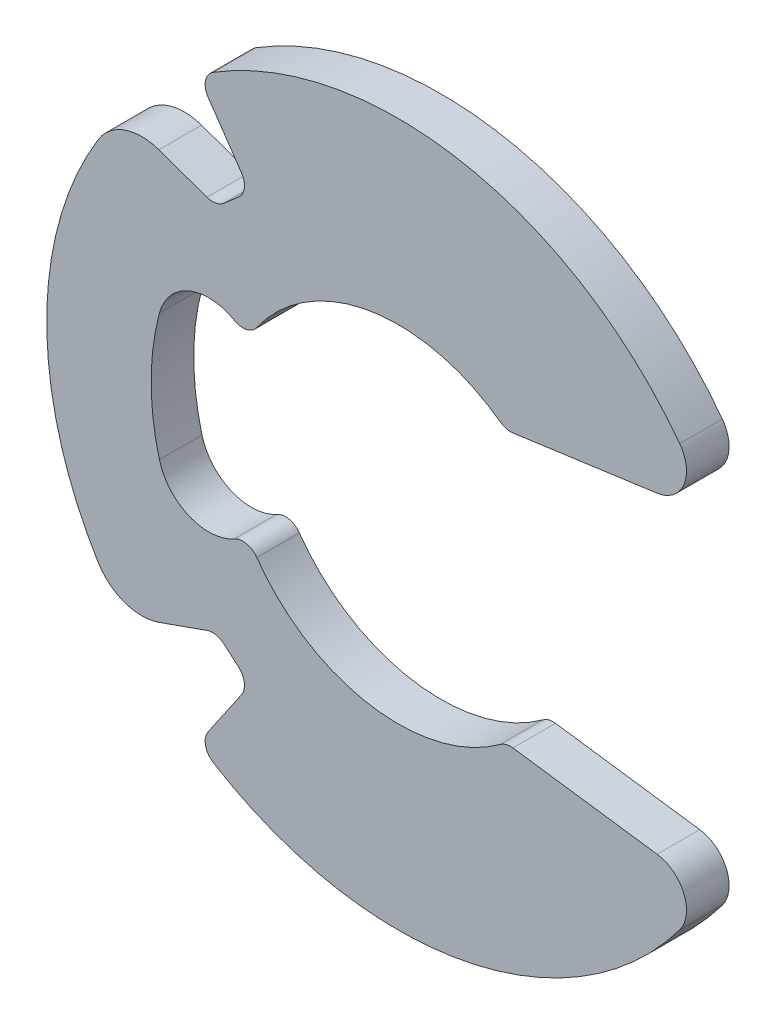
ISO-10303-21;
HEADER;
FILE_DESCRIPTION(('STEP AP214'),'2;1');
FILE_NAME('part.step','',(''),(''),'','','');
FILE_SCHEMA(('AUTOMOTIVE_DESIGN { 1 0 10303 214 1 1 1 1 }'));
ENDSEC;
DATA;
#1=APPLICATION_CONTEXT('core data for automotive mechanical design processes');
#2=APPLICATION_PROTOCOL_DEFINITION('international standard','automotive_design',2000,#1);
#3=PRODUCT_CONTEXT('',#1,'mechanical');
#4=PRODUCT('Part','Part','',(#3));
#5=PRODUCT_RELATED_PRODUCT_CATEGORY('part','',(#4));
#6=PRODUCT_DEFINITION_FORMATION('','',#4);
#7=PRODUCT_DEFINITION_CONTEXT('part definition',#1,'design');
#8=PRODUCT_DEFINITION('design','',#6,#7);
#9=PRODUCT_DEFINITION_SHAPE('','',#8);
#10=(LENGTH_UNIT() NAMED_UNIT(*) SI_UNIT(.MILLI.,.METRE.));
#11=(NAMED_UNIT(*) PLANE_ANGLE_UNIT() SI_UNIT($,.RADIAN.));
#12=(NAMED_UNIT(*) SI_UNIT($,.STERADIAN.) SOLID_ANGLE_UNIT());
#13=UNCERTAINTY_MEASURE_WITH_UNIT(LENGTH_MEASURE(1.E-05),#10,'distance_accuracy_value','');
#14=(GEOMETRIC_REPRESENTATION_CONTEXT(3) GLOBAL_UNCERTAINTY_ASSIGNED_CONTEXT((#13)) GLOBAL_UNIT_ASSIGNED_CONTEXT((#10,
#11,#12)) REPRESENTATION_CONTEXT('',''));
#15=CARTESIAN_POINT('',(0.,0.,0.));
#16=DIRECTION('',(0.,0.,1.));
#17=DIRECTION('',(1.,0.,0.));
#18=AXIS2_PLACEMENT_3D('',#15,#16,#17);
#19=CARTESIAN_POINT('',(0.,0.,1.27));
#20=DIRECTION('',(0.,0.,-1.));
#21=DIRECTION('',(-1.,0.,0.));
#22=AXIS2_PLACEMENT_3D('',#19,#20,#21);
#23=PLANE('',#22);
#24=CARTESIAN_POINT('',(7.57687706687955,-5.66664946537147,1.27));
#25=DIRECTION('',(0.,0.,-1.));
#26=DIRECTION('',(-1.,0.,0.));
#27=AXIS2_PLACEMENT_3D('',#24,#25,#26);
#28=CIRCLE('',#27,1.016);
#29=CARTESIAN_POINT('',(7.71621548730133,-4.66024954258016,1.27));
#30=VERTEX_POINT('',#29);
#31=CARTESIAN_POINT('',(8.39050144990017,-6.27514873682076,1.27));
#32=VERTEX_POINT('',#31);
#33=EDGE_CURVE('E376',#30,#32,#28,.T.);
#34=ORIENTED_EDGE('',*,*,#33,.F.);
#35=DIRECTION('',(0.990551105109562,-0.137144114588364,0.));
#36=VECTOR('',#35,1.);
#37=CARTESIAN_POINT('',(0.,-3.59192148204873,1.27));
#38=LINE('',#37,#36);
#39=CARTESIAN_POINT('',(3.41825205926127,-4.06518646523744,1.27));
#40=VERTEX_POINT('',#39);
#41=EDGE_CURVE('E377',#30,#40,#38,.F.);
#42=ORIENTED_EDGE('',*,*,#41,.T.);
#43=CARTESIAN_POINT('',(3.34858284905039,-4.5683864266331,1.27));
#44=DIRECTION('',(0.,0.,-1.));
#45=DIRECTION('',(-1.,0.,0.));
#46=AXIS2_PLACEMENT_3D('',#43,#44,#45);
#47=CIRCLE('',#46,0.508);
#48=CARTESIAN_POINT('',(3.04826151729699,-4.15866567088125,1.27));
#49=VERTEX_POINT('',#48);
#50=EDGE_CURVE('E20',#49,#40,#47,.T.);
#51=ORIENTED_EDGE('',*,*,#50,.F.);
#52=CARTESIAN_POINT('',(0.,0.,1.27));
#53=DIRECTION('',(0.,0.,-1.));
#54=DIRECTION('',(-1.,0.,0.));
#55=AXIS2_PLACEMENT_3D('',#52,#53,#54);
#56=CIRCLE('',#55,5.1562);
#57=CARTESIAN_POINT('',(-4.21618561440546,-2.96819428354689,1.27));
#58=VERTEX_POINT('',#57);
#59=EDGE_CURVE('E300',#49,#58,#56,.T.);
#60=ORIENTED_EDGE('',*,*,#59,.T.);
#61=CARTESIAN_POINT('',(-4.63157335966707,-3.26062721788648,1.27));
#62=DIRECTION('',(0.,0.,-1.));
#63=DIRECTION('',(-1.,0.,0.));
#64=AXIS2_PLACEMENT_3D('',#61,#62,#63);
#65=CIRCLE('',#64,0.508);
#66=CARTESIAN_POINT('',(-4.88521418696267,-2.82047913970278,1.27));
#67=VERTEX_POINT('',#66);
#68=EDGE_CURVE('E303',#67,#58,#65,.T.);
#69=ORIENTED_EDGE('',*,*,#68,.F.);
#70=CARTESIAN_POINT('',(-5.64613666884946,-1.50003490515168,1.27));
#71=DIRECTION('',(0.,0.,1.));
#72=DIRECTION('',(1.,0.,0.));
#73=AXIS2_PLACEMENT_3D('',#70,#71,#72);
#74=CIRCLE('',#73,1.524);
#75=CARTESIAN_POINT('',(-7.1190418868102,-1.89134835866951,1.27));
#76=VERTEX_POINT('',#75);
#77=EDGE_CURVE('E306',#67,#76,#74,.F.);
#78=ORIENTED_EDGE('',*,*,#77,.T.);
#79=CARTESIAN_POINT('',(0.,0.,1.27));
#80=DIRECTION('',(0.,0.,1.));
#81=DIRECTION('',(1.,0.,0.));
#82=AXIS2_PLACEMENT_3D('',#79,#80,#81);
#83=CIRCLE('',#82,7.366);
#84=CARTESIAN_POINT('',(-7.1190418868102,1.89134835866951,1.27));
#85=VERTEX_POINT('',#84);
#86=EDGE_CURVE('E310',#76,#85,#83,.F.);
#87=ORIENTED_EDGE('',*,*,#86,.T.);
#88=CARTESIAN_POINT('',(-5.64613666884946,1.50003490515168,1.27));
#89=DIRECTION('',(0.,0.,1.));
#90=DIRECTION('',(1.,0.,0.));
#91=AXIS2_PLACEMENT_3D('',#88,#89,#90);
#92=CIRCLE('',#91,1.524);
#93=CARTESIAN_POINT('',(-4.88521418696268,2.82047913970279,1.27));
#94=VERTEX_POINT('',#93);
#95=EDGE_CURVE('E314',#85,#94,#92,.F.);
#96=ORIENTED_EDGE('',*,*,#95,.T.);
#97=CARTESIAN_POINT('',(-4.63157335966708,3.26062721788649,1.27));
#98=DIRECTION('',(0.,0.,1.));
#99=DIRECTION('',(1.,0.,0.));
#100=AXIS2_PLACEMENT_3D('',#97,#98,#99);
#101=CIRCLE('',#100,0.508);
#102=CARTESIAN_POINT('',(-4.21618561440546,2.96819428354689,1.27));
#103=VERTEX_POINT('',#102);
#104=EDGE_CURVE('E316',#103,#94,#101,.F.);
#105=ORIENTED_EDGE('',*,*,#104,.F.);
#106=CARTESIAN_POINT('',(0.,0.,1.27));
#107=DIRECTION('',(0.,0.,-1.));
#108=DIRECTION('',(-1.,0.,0.));
#109=AXIS2_PLACEMENT_3D('',#106,#107,#108);
#110=CIRCLE('',#109,5.1562);
#111=CARTESIAN_POINT('',(3.048261517297,4.15866567088126,1.27));
#112=VERTEX_POINT('',#111);
#113=EDGE_CURVE('E320',#103,#112,#110,.T.);
#114=ORIENTED_EDGE('',*,*,#113,.T.);
#115=CARTESIAN_POINT('',(3.3485828490504,4.5683864266331,1.27));
#116=DIRECTION('',(0.,0.,-1.));
#117=DIRECTION('',(-1.,0.,0.));
#118=AXIS2_PLACEMENT_3D('',#115,#116,#117);
#119=CIRCLE('',#118,0.508);
#120=CARTESIAN_POINT('',(3.41825205926129,4.06518646523745,1.27));
#121=VERTEX_POINT('',#120);
#122=EDGE_CURVE('E324',#121,#112,#119,.T.);
#123=ORIENTED_EDGE('',*,*,#122,.F.);
#124=DIRECTION('',(-0.990551105109562,-0.137144114588364,0.));
#125=VECTOR('',#124,1.);
#126=CARTESIAN_POINT('',(11.2983179723503,5.15619999999999,1.27));
#127=LINE('',#126,#125);
#128=CARTESIAN_POINT('',(7.71621548730134,4.66024954258016,1.27));
#129=VERTEX_POINT('',#128);
#130=EDGE_CURVE('E330',#121,#129,#127,.F.);
#131=ORIENTED_EDGE('',*,*,#130,.T.);
#132=CARTESIAN_POINT('',(7.57687706687956,5.66664946537147,1.27));
#133=DIRECTION('',(0.,0.,-1.));
#134=DIRECTION('',(-1.,0.,0.));
#135=AXIS2_PLACEMENT_3D('',#132,#133,#134);
#136=CIRCLE('',#135,1.016);
#137=CARTESIAN_POINT('',(8.39050144990018,6.27514873682076,1.27));
#138=VERTEX_POINT('',#137);
#139=EDGE_CURVE('E327',#138,#129,#136,.T.);
#140=ORIENTED_EDGE('',*,*,#139,.F.);
#141=CARTESIAN_POINT('',(0.,0.,1.27));
#142=DIRECTION('',(0.,0.,-1.));
#143=DIRECTION('',(-1.,0.,0.));
#144=AXIS2_PLACEMENT_3D('',#141,#142,#143);
#145=CIRCLE('',#144,10.4775);
#146=CARTESIAN_POINT('',(-5.51465485817056,8.90879273780999,1.27));
#147=VERTEX_POINT('',#146);
#148=EDGE_CURVE('E332',#147,#138,#145,.T.);
#149=ORIENTED_EDGE('',*,*,#148,.F.);
#150=CARTESIAN_POINT('',(-5.24727765292592,8.47685127173435,1.27));
#151=DIRECTION('',(0.,0.,-1.));
#152=DIRECTION('',(-1.,0.,0.));
#153=AXIS2_PLACEMENT_3D('',#150,#151,#152);
#154=CIRCLE('',#153,0.508);
#155=CARTESIAN_POINT('',(-5.6664647231543,8.18989099547063,1.27));
#156=VERTEX_POINT('',#155);
#157=EDGE_CURVE('E335',#156,#147,#154,.T.);
#158=ORIENTED_EDGE('',*,*,#157,.F.);
#159=DIRECTION('',(0.564882433590001,-0.825171398087354,0.));
#160=VECTOR('',#159,1.);
#161=CARTESIAN_POINT('',(-7.96096866359448,11.541666359447,1.27));
#162=LINE('',#161,#160);
#163=CARTESIAN_POINT('',(-4.67174469224146,6.73681957776462,1.27));
#164=VERTEX_POINT('',#163);
#165=EDGE_CURVE('E386',#164,#156,#162,.F.);
#166=ORIENTED_EDGE('',*,*,#165,.F.);
#167=CARTESIAN_POINT('',(-5.09093176246983,6.4498593015009,1.27));
#168=DIRECTION('',(0.,0.,-1.));
#169=DIRECTION('',(-1.,0.,0.));
#170=AXIS2_PLACEMENT_3D('',#167,#168,#169);
#171=CIRCLE('',#170,0.508);
#172=CARTESIAN_POINT('',(-4.75923843445855,6.0650950410078,1.27000000000001));
#173=VERTEX_POINT('',#172);
#174=EDGE_CURVE('E339',#164,#173,#171,.T.);
#175=ORIENTED_EDGE('',*,*,#174,.T.);
#176=DIRECTION('',(-0.757409961600578,-0.652939622069462,0.));
#177=VECTOR('',#176,1.);
#178=CARTESIAN_POINT('',(-4.41503502304148,6.36182211981562,1.27000000000001));
#179=LINE('',#178,#177);
#180=CARTESIAN_POINT('',(-5.19974545035898,5.68534761350743,1.27000000000001));
#181=VERTEX_POINT('',#180);
#182=EDGE_CURVE('E390',#181,#173,#179,.F.);
#183=ORIENTED_EDGE('',*,*,#182,.F.);
#184=CARTESIAN_POINT('',(-5.53143877837027,6.07011187400052,1.27));
#185=DIRECTION('',(0.,0.,-1.));
#186=DIRECTION('',(-1.,0.,0.));
#187=AXIS2_PLACEMENT_3D('',#184,#185,#186);
#188=CIRCLE('',#187,0.508);
#189=CARTESIAN_POINT('',(-5.70123922502142,5.59133028672186,1.27));
#190=VERTEX_POINT('',#189);
#191=EDGE_CURVE('E343',#181,#190,#188,.T.);
#192=ORIENTED_EDGE('',*,*,#191,.T.);
#193=DIRECTION('',(-0.942483439524914,0.334252847738487,0.));
#194=VECTOR('',#193,1.);
#195=CARTESIAN_POINT('',(-5.42319262672811,5.49272073732714,1.27));
#196=LINE('',#195,#194);
#197=CARTESIAN_POINT('',(-7.13394241485243,6.09944013892937,1.27));
#198=VERTEX_POINT('',#197);
#199=EDGE_CURVE('E393',#198,#190,#196,.F.);
#200=ORIENTED_EDGE('',*,*,#199,.F.);
#201=CARTESIAN_POINT('',(-7.64334375480589,4.6630953770934,1.27));
#202=DIRECTION('',(0.,0.,-1.));
#203=DIRECTION('',(-1.,0.,0.));
#204=AXIS2_PLACEMENT_3D('',#201,#202,#203);
#205=CIRCLE('',#204,1.524);
#206=CARTESIAN_POINT('',(-8.94433843647498,5.45681373915185,1.27));
#207=VERTEX_POINT('',#206);
#208=EDGE_CURVE('E347',#207,#198,#205,.T.);
#209=ORIENTED_EDGE('',*,*,#208,.F.);
#210=CARTESIAN_POINT('',(0.,0.,1.27));
#211=DIRECTION('',(0.,0.,-1.));
#212=DIRECTION('',(-1.,0.,0.));
#213=AXIS2_PLACEMENT_3D('',#210,#211,#212);
#214=CIRCLE('',#213,10.4775);
#215=CARTESIAN_POINT('',(-8.94433843647497,-5.45681373915185,1.27));
#216=VERTEX_POINT('',#215);
#217=EDGE_CURVE('E351',#216,#207,#214,.T.);
#218=ORIENTED_EDGE('',*,*,#217,.F.);
#219=CARTESIAN_POINT('',(-7.64334375480588,-4.6630953770934,1.27));
#220=DIRECTION('',(0.,0.,-1.));
#221=DIRECTION('',(-1.,0.,0.));
#222=AXIS2_PLACEMENT_3D('',#219,#220,#221);
#223=CIRCLE('',#222,1.524);
#224=CARTESIAN_POINT('',(-7.13394241485243,-6.09944013892937,1.27));
#225=VERTEX_POINT('',#224);
#226=EDGE_CURVE('E355',#225,#216,#223,.T.);
#227=ORIENTED_EDGE('',*,*,#226,.F.);
#228=DIRECTION('',(-0.942483439524914,-0.334252847738487,0.));
#229=VECTOR('',#228,1.);
#230=CARTESIAN_POINT('',(-5.42319262672811,-5.49272073732714,1.27));
#231=LINE('',#230,#229);
#232=CARTESIAN_POINT('',(-5.70123922502142,-5.59133028672186,1.27));
#233=VERTEX_POINT('',#232);
#234=EDGE_CURVE('E396',#225,#233,#231,.F.);
#235=ORIENTED_EDGE('',*,*,#234,.T.);
#236=CARTESIAN_POINT('',(-5.53143877837027,-6.07011187400052,1.27));
#237=DIRECTION('',(0.,0.,-1.));
#238=DIRECTION('',(-1.,0.,0.));
#239=AXIS2_PLACEMENT_3D('',#236,#237,#238);
#240=CIRCLE('',#239,0.508);
#241=CARTESIAN_POINT('',(-5.19974545035898,-5.68534761350743,1.27000000000001));
#242=VERTEX_POINT('',#241);
#243=EDGE_CURVE('E360',#233,#242,#240,.T.);
#244=ORIENTED_EDGE('',*,*,#243,.T.);
#245=DIRECTION('',(-0.757409961600578,0.652939622069462,0.));
#246=VECTOR('',#245,1.);
#247=CARTESIAN_POINT('',(-4.41503502304148,-6.36182211981562,1.27000000000001));
#248=LINE('',#247,#246);
#249=CARTESIAN_POINT('',(-4.75923843445855,-6.0650950410078,1.27000000000001));
#250=VERTEX_POINT('',#249);
#251=EDGE_CURVE('E398',#242,#250,#248,.F.);
#252=ORIENTED_EDGE('',*,*,#251,.T.);
#253=CARTESIAN_POINT('',(-5.09093176246983,-6.4498593015009,1.27));
#254=DIRECTION('',(0.,0.,-1.));
#255=DIRECTION('',(-1.,0.,0.));
#256=AXIS2_PLACEMENT_3D('',#253,#254,#255);
#257=CIRCLE('',#256,0.508);
#258=CARTESIAN_POINT('',(-4.67174469224146,-6.73681957776462,1.27));
#259=VERTEX_POINT('',#258);
#260=EDGE_CURVE('E364',#250,#259,#257,.T.);
#261=ORIENTED_EDGE('',*,*,#260,.T.);
#262=DIRECTION('',(0.56488243359,0.825171398087354,0.));
#263=VECTOR('',#262,1.);
#264=CARTESIAN_POINT('',(-7.96096866359448,-11.541666359447,1.27));
#265=LINE('',#264,#263);
#266=CARTESIAN_POINT('',(-5.66646472315429,-8.18989099547062,1.27));
#267=VERTEX_POINT('',#266);
#268=EDGE_CURVE('E371',#259,#267,#265,.F.);
#269=ORIENTED_EDGE('',*,*,#268,.T.);
#270=CARTESIAN_POINT('',(-5.24727765292592,-8.47685127173434,1.27));
#271=DIRECTION('',(0.,0.,-1.));
#272=DIRECTION('',(-1.,0.,0.));
#273=AXIS2_PLACEMENT_3D('',#270,#271,#272);
#274=CIRCLE('',#273,0.508);
#275=CARTESIAN_POINT('',(-5.51465485817055,-8.90879273780997,1.27));
#276=VERTEX_POINT('',#275);
#277=EDGE_CURVE('E368',#276,#267,#274,.T.);
#278=ORIENTED_EDGE('',*,*,#277,.F.);
#279=CARTESIAN_POINT('',(0.,0.,1.27));
#280=DIRECTION('',(0.,0.,-1.));
#281=DIRECTION('',(-1.,0.,0.));
#282=AXIS2_PLACEMENT_3D('',#279,#280,#281);
#283=CIRCLE('',#282,10.4775);
#284=EDGE_CURVE('E373',#32,#276,#283,.T.);
#285=ORIENTED_EDGE('',*,*,#284,.F.);
#286=EDGE_LOOP('',(#34,#42,#51,#60,#69,#78,#87,#96,#105,#114,#123,#131,#140,#149,#158,#166,#175,
#183,#192,#200,#209,#218,#227,#235,#244,#252,#261,#269,#278,#285));
#287=FACE_BOUND('',#286,.T.);
#288=ADVANCED_FACE('F17',(#287),#23,.F.);
#289=CARTESIAN_POINT('',(0.,-3.59192148204873,-28.9774986298856));
#290=DIRECTION('',(-0.137144114588364,-0.990551105109562,0.));
#291=DIRECTION('',(0.990551105109562,-0.137144114588364,0.));
#292=AXIS2_PLACEMENT_3D('',#289,#290,#291);
#293=PLANE('',#292);
#294=DIRECTION('',(0.,0.,-1.));
#295=VECTOR('',#294,1.);
#296=CARTESIAN_POINT('',(7.71621548730133,-4.66024954258016,1.27));
#297=LINE('',#296,#295);
#298=CARTESIAN_POINT('',(7.71621548730133,-4.66024954258016,0.));
#299=VERTEX_POINT('',#298);
#300=EDGE_CURVE('E222',#299,#30,#297,.F.);
#301=ORIENTED_EDGE('',*,*,#300,.F.);
#302=DIRECTION('',(0.990551105109562,-0.137144114588363,0.));
#303=VECTOR('',#302,1.);
#304=CARTESIAN_POINT('',(3.41825205926127,-4.06518646523744,0.));
#305=LINE('',#304,#303);
#306=CARTESIAN_POINT('',(3.41825205926127,-4.06518646523744,0.));
#307=VERTEX_POINT('',#306);
#308=EDGE_CURVE('E217',#307,#299,#305,.T.);
#309=ORIENTED_EDGE('',*,*,#308,.F.);
#310=DIRECTION('',(0.,0.,-1.));
#311=VECTOR('',#310,1.);
#312=CARTESIAN_POINT('',(3.41825205926127,-4.06518646523744,1.27));
#313=LINE('',#312,#311);
#314=EDGE_CURVE('E220',#40,#307,#313,.T.);
#315=ORIENTED_EDGE('',*,*,#314,.F.);
#316=ORIENTED_EDGE('',*,*,#41,.F.);
#317=EDGE_LOOP('',(#301,#309,#315,#316));
#318=FACE_BOUND('',#317,.T.);
#319=ADVANCED_FACE('F218',(#318),#293,.F.);
#320=CARTESIAN_POINT('',(7.57687706687955,-5.66664946537147,1.27));
#321=DIRECTION('',(0.,0.,-1.));
#322=DIRECTION('',(-1.,0.,0.));
#323=AXIS2_PLACEMENT_3D('',#320,#321,#322);
#324=CYLINDRICAL_SURFACE('',#323,1.016);
#325=CARTESIAN_POINT('',(7.57687706687955,-5.66664946537147,0.));
#326=DIRECTION('',(0.,0.,-1.));
#327=DIRECTION('',(-1.,0.,0.));
#328=AXIS2_PLACEMENT_3D('',#325,#326,#327);
#329=CIRCLE('',#328,1.016);
#330=CARTESIAN_POINT('',(8.39050144990017,-6.27514873682076,0.));
#331=VERTEX_POINT('',#330);
#332=EDGE_CURVE('E226',#299,#331,#329,.T.);
#333=ORIENTED_EDGE('',*,*,#332,.F.);
#334=ORIENTED_EDGE('',*,*,#300,.T.);
#335=ORIENTED_EDGE('',*,*,#33,.T.);
#336=DIRECTION('',(0.,0.,-1.));
#337=VECTOR('',#336,1.);
#338=CARTESIAN_POINT('',(8.39050144990017,-6.27514873682076,1.27));
#339=LINE('',#338,#337);
#340=EDGE_CURVE('E375',#331,#32,#339,.F.);
#341=ORIENTED_EDGE('',*,*,#340,.F.);
#342=EDGE_LOOP('',(#333,#334,#335,#341));
#343=FACE_BOUND('',#342,.T.);
#344=ADVANCED_FACE('F414',(#343),#324,.T.);
#345=CARTESIAN_POINT('',(0.,0.,1.27));
#346=DIRECTION('',(0.,0.,-1.));
#347=DIRECTION('',(-1.,0.,0.));
#348=AXIS2_PLACEMENT_3D('',#345,#346,#347);
#349=CYLINDRICAL_SURFACE('',#348,10.4775);
#350=ORIENTED_EDGE('',*,*,#284,.T.);
#351=DIRECTION('',(0.,0.,-1.));
#352=VECTOR('',#351,1.);
#353=CARTESIAN_POINT('',(-5.51465485817055,-8.90879273780998,1.27));
#354=LINE('',#353,#352);
#355=CARTESIAN_POINT('',(-5.51465485817055,-8.90879273780997,0.));
#356=VERTEX_POINT('',#355);
#357=EDGE_CURVE('E372',#356,#276,#354,.F.);
#358=ORIENTED_EDGE('',*,*,#357,.F.);
#359=CARTESIAN_POINT('',(0.,0.,0.));
#360=DIRECTION('',(0.,0.,-1.));
#361=DIRECTION('',(-1.,0.,0.));
#362=AXIS2_PLACEMENT_3D('',#359,#360,#361);
#363=CIRCLE('',#362,10.4775);
#364=EDGE_CURVE('E296',#331,#356,#363,.T.);
#365=ORIENTED_EDGE('',*,*,#364,.F.);
#366=ORIENTED_EDGE('',*,*,#340,.T.);
#367=EDGE_LOOP('',(#350,#358,#365,#366));
#368=FACE_BOUND('',#367,.T.);
#369=ADVANCED_FACE('F413',(#368),#349,.T.);
#370=CARTESIAN_POINT('',(-5.24727765292592,-8.47685127173434,1.27));
#371=DIRECTION('',(0.,0.,-1.));
#372=DIRECTION('',(-1.,0.,0.));
#373=AXIS2_PLACEMENT_3D('',#370,#371,#372);
#374=CYLINDRICAL_SURFACE('',#373,0.508);
#375=DIRECTION('',(0.,0.,1.));
#376=VECTOR('',#375,1.);
#377=CARTESIAN_POINT('',(-5.66646472315429,-8.18989099547062,-28.9619533727259));
#378=LINE('',#377,#376);
#379=CARTESIAN_POINT('',(-5.6664647231543,-8.18989099547062,0.));
#380=VERTEX_POINT('',#379);
#381=EDGE_CURVE('E367',#267,#380,#378,.F.);
#382=ORIENTED_EDGE('',*,*,#381,.T.);
#383=CARTESIAN_POINT('',(-5.24727765292592,-8.47685127173434,0.));
#384=DIRECTION('',(0.,0.,-1.));
#385=DIRECTION('',(-1.,0.,0.));
#386=AXIS2_PLACEMENT_3D('',#383,#384,#385);
#387=CIRCLE('',#386,0.508);
#388=EDGE_CURVE('E294',#356,#380,#387,.T.);
#389=ORIENTED_EDGE('',*,*,#388,.F.);
#390=ORIENTED_EDGE('',*,*,#357,.T.);
#391=ORIENTED_EDGE('',*,*,#277,.T.);
#392=EDGE_LOOP('',(#382,#389,#390,#391));
#393=FACE_BOUND('',#392,.T.);
#394=ADVANCED_FACE('F416',(#393),#374,.T.);
#395=CARTESIAN_POINT('',(-7.96096866359448,-11.541666359447,-28.9619533727259));
#396=DIRECTION('',(0.825171398087354,-0.56488243359,0.));
#397=DIRECTION('',(0.56488243359,0.825171398087354,0.));
#398=AXIS2_PLACEMENT_3D('',#395,#396,#397);
#399=PLANE('',#398);
#400=ORIENTED_EDGE('',*,*,#381,.F.);
#401=ORIENTED_EDGE('',*,*,#268,.F.);
#402=DIRECTION('',(0.,0.,-1.));
#403=VECTOR('',#402,1.);
#404=CARTESIAN_POINT('',(-4.67174469224146,-6.73681957776462,-28.9619533727259));
#405=LINE('',#404,#403);
#406=CARTESIAN_POINT('',(-4.67174469224146,-6.73681957776462,0.));
#407=VERTEX_POINT('',#406);
#408=EDGE_CURVE('E366',#259,#407,#405,.T.);
#409=ORIENTED_EDGE('',*,*,#408,.T.);
#410=DIRECTION('',(0.564882433590003,0.825171398087353,0.));
#411=VECTOR('',#410,1.);
#412=CARTESIAN_POINT('',(-5.6664647231543,-8.18989099547062,0.));
#413=LINE('',#412,#411);
#414=EDGE_CURVE('E293',#380,#407,#413,.T.);
#415=ORIENTED_EDGE('',*,*,#414,.F.);
#416=EDGE_LOOP('',(#400,#401,#409,#415));
#417=FACE_BOUND('',#416,.T.);
#418=ADVANCED_FACE('F418',(#417),#399,.F.);
#419=CARTESIAN_POINT('',(-5.09093176246983,-6.4498593015009,-28.9619533727259));
#420=DIRECTION('',(0.,0.,-1.));
#421=DIRECTION('',(-1.,0.,0.));
#422=AXIS2_PLACEMENT_3D('',#419,#420,#421);
#423=CYLINDRICAL_SURFACE('',#422,0.508);
#424=ORIENTED_EDGE('',*,*,#408,.F.);
#425=ORIENTED_EDGE('',*,*,#260,.F.);
#426=DIRECTION('',(0.,0.,1.));
#427=VECTOR('',#426,1.);
#428=CARTESIAN_POINT('',(-4.75923843445855,-6.0650950410078,-28.9619533727259));
#429=LINE('',#428,#427);
#430=CARTESIAN_POINT('',(-4.75923843445855,-6.0650950410078,0.));
#431=VERTEX_POINT('',#430);
#432=EDGE_CURVE('E363',#250,#431,#429,.F.);
#433=ORIENTED_EDGE('',*,*,#432,.T.);
#434=CARTESIAN_POINT('',(-5.09093176246983,-6.4498593015009,0.));
#435=DIRECTION('',(0.,0.,-1.));
#436=DIRECTION('',(-1.,0.,0.));
#437=AXIS2_PLACEMENT_3D('',#434,#435,#436);
#438=CIRCLE('',#437,0.508);
#439=EDGE_CURVE('E290',#407,#431,#438,.F.);
#440=ORIENTED_EDGE('',*,*,#439,.F.);
#441=EDGE_LOOP('',(#424,#425,#433,#440));
#442=FACE_BOUND('',#441,.T.);
#443=ADVANCED_FACE('F463',(#442),#423,.F.);
#444=CARTESIAN_POINT('',(-4.41503502304148,-6.36182211981562,-28.9619533727259));
#445=DIRECTION('',(0.652939622069462,0.757409961600578,0.));
#446=DIRECTION('',(-0.757409961600578,0.652939622069462,0.));
#447=AXIS2_PLACEMENT_3D('',#444,#445,#446);
#448=PLANE('',#447);
#449=ORIENTED_EDGE('',*,*,#432,.F.);
#450=ORIENTED_EDGE('',*,*,#251,.F.);
#451=DIRECTION('',(0.,0.,-1.));
#452=VECTOR('',#451,1.);
#453=CARTESIAN_POINT('',(-5.19974545035899,-5.68534761350743,-28.9619533727259));
#454=LINE('',#453,#452);
#455=CARTESIAN_POINT('',(-5.19974545035898,-5.68534761350743,0.));
#456=VERTEX_POINT('',#455);
#457=EDGE_CURVE('E362',#242,#456,#454,.T.);
#458=ORIENTED_EDGE('',*,*,#457,.T.);
#459=DIRECTION('',(-0.757409961600581,0.652939622069458,0.));
#460=VECTOR('',#459,1.);
#461=CARTESIAN_POINT('',(-4.75923843445854,-6.0650950410078,0.));
#462=LINE('',#461,#460);
#463=EDGE_CURVE('E289',#431,#456,#462,.T.);
#464=ORIENTED_EDGE('',*,*,#463,.F.);
#465=EDGE_LOOP('',(#449,#450,#458,#464));
#466=FACE_BOUND('',#465,.T.);
#467=ADVANCED_FACE('F467',(#466),#448,.F.);
#468=CARTESIAN_POINT('',(-5.53143877837027,-6.07011187400052,-28.9619533727259));
#469=DIRECTION('',(0.,0.,-1.));
#470=DIRECTION('',(-1.,0.,0.));
#471=AXIS2_PLACEMENT_3D('',#468,#469,#470);
#472=CYLINDRICAL_SURFACE('',#471,0.508);
#473=ORIENTED_EDGE('',*,*,#457,.F.);
#474=ORIENTED_EDGE('',*,*,#243,.F.);
#475=DIRECTION('',(0.,0.,1.));
#476=VECTOR('',#475,1.);
#477=CARTESIAN_POINT('',(-5.70123922502142,-5.59133028672186,-28.9619533727259));
#478=LINE('',#477,#476);
#479=CARTESIAN_POINT('',(-5.70123922502142,-5.59133028672186,0.));
#480=VERTEX_POINT('',#479);
#481=EDGE_CURVE('E359',#233,#480,#478,.F.);
#482=ORIENTED_EDGE('',*,*,#481,.T.);
#483=CARTESIAN_POINT('',(-5.53143877837027,-6.07011187400052,0.));
#484=DIRECTION('',(0.,0.,-1.));
#485=DIRECTION('',(-1.,0.,0.));
#486=AXIS2_PLACEMENT_3D('',#483,#484,#485);
#487=CIRCLE('',#486,0.508);
#488=EDGE_CURVE('E286',#456,#480,#487,.F.);
#489=ORIENTED_EDGE('',*,*,#488,.F.);
#490=EDGE_LOOP('',(#473,#474,#482,#489));
#491=FACE_BOUND('',#490,.T.);
#492=ADVANCED_FACE('F473',(#491),#472,.F.);
#493=CARTESIAN_POINT('',(-5.42319262672811,-5.49272073732714,-28.9619533727259));
#494=DIRECTION('',(-0.334252847738487,0.942483439524914,0.));
#495=DIRECTION('',(-0.942483439524914,-0.334252847738487,0.));
#496=AXIS2_PLACEMENT_3D('',#493,#494,#495);
#497=PLANE('',#496);
#498=ORIENTED_EDGE('',*,*,#481,.F.);
#499=ORIENTED_EDGE('',*,*,#234,.F.);
#500=DIRECTION('',(0.,0.,-1.));
#501=VECTOR('',#500,1.);
#502=CARTESIAN_POINT('',(-7.13394241485243,-6.09944013892937,1.27));
#503=LINE('',#502,#501);
#504=CARTESIAN_POINT('',(-7.13394241485243,-6.09944013892937,0.));
#505=VERTEX_POINT('',#504);
#506=EDGE_CURVE('E358',#505,#225,#503,.F.);
#507=ORIENTED_EDGE('',*,*,#506,.F.);
#508=DIRECTION('',(-0.942483439524914,-0.334252847738488,0.));
#509=VECTOR('',#508,1.);
#510=CARTESIAN_POINT('',(-5.70123922502142,-5.59133028672186,0.));
#511=LINE('',#510,#509);
#512=EDGE_CURVE('E285',#480,#505,#511,.T.);
#513=ORIENTED_EDGE('',*,*,#512,.F.);
#514=EDGE_LOOP('',(#498,#499,#507,#513));
#515=FACE_BOUND('',#514,.T.);
#516=ADVANCED_FACE('F478',(#515),#497,.F.);
#517=CARTESIAN_POINT('',(-7.64334375480588,-4.6630953770934,1.27));
#518=DIRECTION('',(0.,0.,-1.));
#519=DIRECTION('',(-1.,0.,0.));
#520=AXIS2_PLACEMENT_3D('',#517,#518,#519);
#521=CYLINDRICAL_SURFACE('',#520,1.524);
#522=CARTESIAN_POINT('',(-7.64334375480588,-4.6630953770934,0.));
#523=DIRECTION('',(0.,0.,-1.));
#524=DIRECTION('',(-1.,0.,0.));
#525=AXIS2_PLACEMENT_3D('',#522,#523,#524);
#526=CIRCLE('',#525,1.524);
#527=CARTESIAN_POINT('',(-8.94433843647497,-5.45681373915185,0.));
#528=VERTEX_POINT('',#527);
#529=EDGE_CURVE('E282',#505,#528,#526,.T.);
#530=ORIENTED_EDGE('',*,*,#529,.F.);
#531=ORIENTED_EDGE('',*,*,#506,.T.);
#532=ORIENTED_EDGE('',*,*,#226,.T.);
#533=DIRECTION('',(0.,0.,-1.));
#534=VECTOR('',#533,1.);
#535=CARTESIAN_POINT('',(-8.94433843647497,-5.45681373915185,1.27));
#536=LINE('',#535,#534);
#537=EDGE_CURVE('E354',#528,#216,#536,.F.);
#538=ORIENTED_EDGE('',*,*,#537,.F.);
#539=EDGE_LOOP('',(#530,#531,#532,#538));
#540=FACE_BOUND('',#539,.T.);
#541=ADVANCED_FACE('F559',(#540),#521,.T.);
#542=CARTESIAN_POINT('',(0.,0.,1.27));
#543=DIRECTION('',(0.,0.,-1.));
#544=DIRECTION('',(-1.,0.,0.));
#545=AXIS2_PLACEMENT_3D('',#542,#543,#544);
#546=CYLINDRICAL_SURFACE('',#545,10.4775);
#547=DIRECTION('',(0.,0.,-1.));
#548=VECTOR('',#547,1.);
#549=CARTESIAN_POINT('',(-8.94433843647498,5.45681373915185,1.27));
#550=LINE('',#549,#548);
#551=CARTESIAN_POINT('',(-8.94433843647498,5.45681373915185,0.));
#552=VERTEX_POINT('',#551);
#553=EDGE_CURVE('E350',#552,#207,#550,.F.);
#554=ORIENTED_EDGE('',*,*,#553,.F.);
#555=CARTESIAN_POINT('',(0.,0.,0.));
#556=DIRECTION('',(0.,0.,-1.));
#557=DIRECTION('',(-1.,0.,0.));
#558=AXIS2_PLACEMENT_3D('',#555,#556,#557);
#559=CIRCLE('',#558,10.4775);
#560=EDGE_CURVE('E280',#528,#552,#559,.T.);
#561=ORIENTED_EDGE('',*,*,#560,.F.);
#562=ORIENTED_EDGE('',*,*,#537,.T.);
#563=ORIENTED_EDGE('',*,*,#217,.T.);
#564=EDGE_LOOP('',(#554,#561,#562,#563));
#565=FACE_BOUND('',#564,.T.);
#566=ADVANCED_FACE('F557',(#565),#546,.T.);
#567=CARTESIAN_POINT('',(-7.64334375480589,4.6630953770934,1.27));
#568=DIRECTION('',(0.,0.,-1.));
#569=DIRECTION('',(-1.,0.,0.));
#570=AXIS2_PLACEMENT_3D('',#567,#568,#569);
#571=CYLINDRICAL_SURFACE('',#570,1.524);
#572=CARTESIAN_POINT('',(-7.64334375480589,4.6630953770934,0.));
#573=DIRECTION('',(0.,0.,-1.));
#574=DIRECTION('',(-1.,0.,0.));
#575=AXIS2_PLACEMENT_3D('',#572,#573,#574);
#576=CIRCLE('',#575,1.524);
#577=CARTESIAN_POINT('',(-7.13394241485243,6.09944013892937,0.));
#578=VERTEX_POINT('',#577);
#579=EDGE_CURVE('E277',#552,#578,#576,.T.);
#580=ORIENTED_EDGE('',*,*,#579,.F.);
#581=ORIENTED_EDGE('',*,*,#553,.T.);
#582=ORIENTED_EDGE('',*,*,#208,.T.);
#583=DIRECTION('',(0.,0.,1.));
#584=VECTOR('',#583,1.);
#585=CARTESIAN_POINT('',(-7.13394241485243,6.09944013892937,-28.9619533727259));
#586=LINE('',#585,#584);
#587=EDGE_CURVE('E346',#578,#198,#586,.T.);
#588=ORIENTED_EDGE('',*,*,#587,.F.);
#589=EDGE_LOOP('',(#580,#581,#582,#588));
#590=FACE_BOUND('',#589,.T.);
#591=ADVANCED_FACE('F553',(#590),#571,.T.);
#592=CARTESIAN_POINT('',(-5.42319262672811,5.49272073732714,-28.9619533727259));
#593=DIRECTION('',(0.334252847738487,0.942483439524914,0.));
#594=DIRECTION('',(-0.942483439524914,0.334252847738487,0.));
#595=AXIS2_PLACEMENT_3D('',#592,#593,#594);
#596=PLANE('',#595);
#597=DIRECTION('',(0.942483439524914,-0.334252847738487,0.));
#598=VECTOR('',#597,1.);
#599=CARTESIAN_POINT('',(-7.13394241485243,6.09944013892937,0.));
#600=LINE('',#599,#598);
#601=CARTESIAN_POINT('',(-5.70123922502142,5.59133028672186,0.));
#602=VERTEX_POINT('',#601);
#603=EDGE_CURVE('E276',#578,#602,#600,.T.);
#604=ORIENTED_EDGE('',*,*,#603,.F.);
#605=ORIENTED_EDGE('',*,*,#587,.T.);
#606=ORIENTED_EDGE('',*,*,#199,.T.);
#607=DIRECTION('',(0.,0.,-1.));
#608=VECTOR('',#607,1.);
#609=CARTESIAN_POINT('',(-5.70123922502142,5.59133028672186,-28.9619533727259));
#610=LINE('',#609,#608);
#611=EDGE_CURVE('E345',#190,#602,#610,.T.);
#612=ORIENTED_EDGE('',*,*,#611,.T.);
#613=EDGE_LOOP('',(#604,#605,#606,#612));
#614=FACE_BOUND('',#613,.T.);
#615=ADVANCED_FACE('F550',(#614),#596,.T.);
#616=CARTESIAN_POINT('',(-5.53143877837027,6.07011187400052,-28.9619533727259));
#617=DIRECTION('',(0.,0.,-1.));
#618=DIRECTION('',(-1.,0.,0.));
#619=AXIS2_PLACEMENT_3D('',#616,#617,#618);
#620=CYLINDRICAL_SURFACE('',#619,0.508);
#621=ORIENTED_EDGE('',*,*,#611,.F.);
#622=ORIENTED_EDGE('',*,*,#191,.F.);
#623=DIRECTION('',(0.,0.,1.));
#624=VECTOR('',#623,1.);
#625=CARTESIAN_POINT('',(-5.19974545035898,5.68534761350743,-28.9619533727259));
#626=LINE('',#625,#624);
#627=CARTESIAN_POINT('',(-5.19974545035898,5.68534761350743,0.));
#628=VERTEX_POINT('',#627);
#629=EDGE_CURVE('E342',#628,#181,#626,.T.);
#630=ORIENTED_EDGE('',*,*,#629,.F.);
#631=CARTESIAN_POINT('',(-5.53143877837027,6.07011187400052,0.));
#632=DIRECTION('',(0.,0.,-1.));
#633=DIRECTION('',(-1.,0.,0.));
#634=AXIS2_PLACEMENT_3D('',#631,#632,#633);
#635=CIRCLE('',#634,0.508);
#636=EDGE_CURVE('E273',#602,#628,#635,.F.);
#637=ORIENTED_EDGE('',*,*,#636,.F.);
#638=EDGE_LOOP('',(#621,#622,#630,#637));
#639=FACE_BOUND('',#638,.T.);
#640=ADVANCED_FACE('F546',(#639),#620,.F.);
#641=CARTESIAN_POINT('',(-4.41503502304148,6.36182211981562,-28.9619533727259));
#642=DIRECTION('',(-0.652939622069462,0.757409961600578,0.));
#643=DIRECTION('',(-0.757409961600578,-0.652939622069462,0.));
#644=AXIS2_PLACEMENT_3D('',#641,#642,#643);
#645=PLANE('',#644);
#646=DIRECTION('',(0.757409961600573,0.652939622069468,0.));
#647=VECTOR('',#646,1.);
#648=CARTESIAN_POINT('',(-5.19974545035898,5.68534761350743,0.));
#649=LINE('',#648,#647);
#650=CARTESIAN_POINT('',(-4.75923843445855,6.0650950410078,0.));
#651=VERTEX_POINT('',#650);
#652=EDGE_CURVE('E272',#628,#651,#649,.T.);
#653=ORIENTED_EDGE('',*,*,#652,.F.);
#654=ORIENTED_EDGE('',*,*,#629,.T.);
#655=ORIENTED_EDGE('',*,*,#182,.T.);
#656=DIRECTION('',(0.,0.,-1.));
#657=VECTOR('',#656,1.);
#658=CARTESIAN_POINT('',(-4.75923843445855,6.0650950410078,-28.9619533727259));
#659=LINE('',#658,#657);
#660=EDGE_CURVE('E341',#173,#651,#659,.T.);
#661=ORIENTED_EDGE('',*,*,#660,.T.);
#662=EDGE_LOOP('',(#653,#654,#655,#661));
#663=FACE_BOUND('',#662,.T.);
#664=ADVANCED_FACE('F542',(#663),#645,.T.);
#665=CARTESIAN_POINT('',(-5.09093176246983,6.4498593015009,-28.9619533727259));
#666=DIRECTION('',(0.,0.,-1.));
#667=DIRECTION('',(-1.,0.,0.));
#668=AXIS2_PLACEMENT_3D('',#665,#666,#667);
#669=CYLINDRICAL_SURFACE('',#668,0.508);
#670=ORIENTED_EDGE('',*,*,#660,.F.);
#671=ORIENTED_EDGE('',*,*,#174,.F.);
#672=DIRECTION('',(0.,0.,1.));
#673=VECTOR('',#672,1.);
#674=CARTESIAN_POINT('',(-4.67174469224146,6.73681957776462,-28.9619533727259));
#675=LINE('',#674,#673);
#676=CARTESIAN_POINT('',(-4.67174469224146,6.73681957776462,0.));
#677=VERTEX_POINT('',#676);
#678=EDGE_CURVE('E389',#677,#164,#675,.T.);
#679=ORIENTED_EDGE('',*,*,#678,.F.);
#680=CARTESIAN_POINT('',(-5.09093176246983,6.4498593015009,0.));
#681=DIRECTION('',(0.,0.,-1.));
#682=DIRECTION('',(-1.,0.,0.));
#683=AXIS2_PLACEMENT_3D('',#680,#681,#682);
#684=CIRCLE('',#683,0.508);
#685=EDGE_CURVE('E269',#651,#677,#684,.F.);
#686=ORIENTED_EDGE('',*,*,#685,.F.);
#687=EDGE_LOOP('',(#670,#671,#679,#686));
#688=FACE_BOUND('',#687,.T.);
#689=ADVANCED_FACE('F538',(#688),#669,.F.);
#690=CARTESIAN_POINT('',(-7.96096866359448,11.541666359447,-28.9619533727259));
#691=DIRECTION('',(-0.825171398087354,-0.564882433590001,0.));
#692=DIRECTION('',(0.564882433590001,-0.825171398087354,0.));
#693=AXIS2_PLACEMENT_3D('',#690,#691,#692);
#694=PLANE('',#693);
#695=DIRECTION('',(-0.56488243359,0.825171398087354,0.));
#696=VECTOR('',#695,1.);
#697=CARTESIAN_POINT('',(-4.67174469224146,6.73681957776462,0.));
#698=LINE('',#697,#696);
#699=CARTESIAN_POINT('',(-5.6664647231543,8.18989099547063,0.));
#700=VERTEX_POINT('',#699);
#701=EDGE_CURVE('E268',#677,#700,#698,.T.);
#702=ORIENTED_EDGE('',*,*,#701,.F.);
#703=ORIENTED_EDGE('',*,*,#678,.T.);
#704=ORIENTED_EDGE('',*,*,#165,.T.);
#705=DIRECTION('',(0.,0.,-1.));
#706=VECTOR('',#705,1.);
#707=CARTESIAN_POINT('',(-5.6664647231543,8.18989099547063,1.27));
#708=LINE('',#707,#706);
#709=EDGE_CURVE('E338',#700,#156,#708,.F.);
#710=ORIENTED_EDGE('',*,*,#709,.F.);
#711=EDGE_LOOP('',(#702,#703,#704,#710));
#712=FACE_BOUND('',#711,.T.);
#713=ADVANCED_FACE('F534',(#712),#694,.T.);
#714=CARTESIAN_POINT('',(-5.24727765292592,8.47685127173435,1.27));
#715=DIRECTION('',(0.,0.,-1.));
#716=DIRECTION('',(-1.,0.,0.));
#717=AXIS2_PLACEMENT_3D('',#714,#715,#716);
#718=CYLINDRICAL_SURFACE('',#717,0.508);
#719=DIRECTION('',(0.,0.,-1.));
#720=VECTOR('',#719,1.);
#721=CARTESIAN_POINT('',(-5.51465485817056,8.90879273780999,1.27));
#722=LINE('',#721,#720);
#723=CARTESIAN_POINT('',(-5.51465485817056,8.90879273780999,0.));
#724=VERTEX_POINT('',#723);
#725=EDGE_CURVE('E334',#724,#147,#722,.F.);
#726=ORIENTED_EDGE('',*,*,#725,.F.);
#727=CARTESIAN_POINT('',(-5.24727765292592,8.47685127173435,0.));
#728=DIRECTION('',(0.,0.,-1.));
#729=DIRECTION('',(-1.,0.,0.));
#730=AXIS2_PLACEMENT_3D('',#727,#728,#729);
#731=CIRCLE('',#730,0.508);
#732=EDGE_CURVE('E266',#700,#724,#731,.T.);
#733=ORIENTED_EDGE('',*,*,#732,.F.);
#734=ORIENTED_EDGE('',*,*,#709,.T.);
#735=ORIENTED_EDGE('',*,*,#157,.T.);
#736=EDGE_LOOP('',(#726,#733,#734,#735));
#737=FACE_BOUND('',#736,.T.);
#738=ADVANCED_FACE('F530',(#737),#718,.T.);
#739=CARTESIAN_POINT('',(0.,0.,1.27));
#740=DIRECTION('',(0.,0.,-1.));
#741=DIRECTION('',(-1.,0.,0.));
#742=AXIS2_PLACEMENT_3D('',#739,#740,#741);
#743=CYLINDRICAL_SURFACE('',#742,10.4775);
#744=CARTESIAN_POINT('',(0.,0.,0.));
#745=DIRECTION('',(0.,0.,-1.));
#746=DIRECTION('',(-1.,0.,0.));
#747=AXIS2_PLACEMENT_3D('',#744,#745,#746);
#748=CIRCLE('',#747,10.4775);
#749=CARTESIAN_POINT('',(8.39050144990018,6.27514873682076,0.));
#750=VERTEX_POINT('',#749);
#751=EDGE_CURVE('E263',#724,#750,#748,.T.);
#752=ORIENTED_EDGE('',*,*,#751,.F.);
#753=ORIENTED_EDGE('',*,*,#725,.T.);
#754=ORIENTED_EDGE('',*,*,#148,.T.);
#755=DIRECTION('',(0.,0.,-1.));
#756=VECTOR('',#755,1.);
#757=CARTESIAN_POINT('',(8.39050144990018,6.27514873682076,1.27));
#758=LINE('',#757,#756);
#759=EDGE_CURVE('E331',#750,#138,#758,.F.);
#760=ORIENTED_EDGE('',*,*,#759,.F.);
#761=EDGE_LOOP('',(#752,#753,#754,#760));
#762=FACE_BOUND('',#761,.T.);
#763=ADVANCED_FACE('F527',(#762),#743,.T.);
#764=CARTESIAN_POINT('',(7.57687706687956,5.66664946537147,1.27));
#765=DIRECTION('',(0.,0.,-1.));
#766=DIRECTION('',(-1.,0.,0.));
#767=AXIS2_PLACEMENT_3D('',#764,#765,#766);
#768=CYLINDRICAL_SURFACE('',#767,1.016);
#769=ORIENTED_EDGE('',*,*,#139,.T.);
#770=DIRECTION('',(0.,0.,1.));
#771=VECTOR('',#770,1.);
#772=CARTESIAN_POINT('',(7.71621548730134,4.66024954258016,-28.9774986298856));
#773=LINE('',#772,#771);
#774=CARTESIAN_POINT('',(7.71621548730134,4.66024954258016,0.));
#775=VERTEX_POINT('',#774);
#776=EDGE_CURVE('E385',#129,#775,#773,.F.);
#777=ORIENTED_EDGE('',*,*,#776,.T.);
#778=CARTESIAN_POINT('',(7.57687706687956,5.66664946537147,0.));
#779=DIRECTION('',(0.,0.,-1.));
#780=DIRECTION('',(-1.,0.,0.));
#781=AXIS2_PLACEMENT_3D('',#778,#779,#780);
#782=CIRCLE('',#781,1.016);
#783=EDGE_CURVE('E260',#750,#775,#782,.T.);
#784=ORIENTED_EDGE('',*,*,#783,.F.);
#785=ORIENTED_EDGE('',*,*,#759,.T.);
#786=EDGE_LOOP('',(#769,#777,#784,#785));
#787=FACE_BOUND('',#786,.T.);
#788=ADVANCED_FACE('F524',(#787),#768,.T.);
#789=CARTESIAN_POINT('',(11.2983179723503,5.15619999999999,-28.9774986298856));
#790=DIRECTION('',(-0.137144114588364,0.990551105109562,0.));
#791=DIRECTION('',(-0.990551105109562,-0.137144114588364,0.));
#792=AXIS2_PLACEMENT_3D('',#789,#790,#791);
#793=PLANE('',#792);
#794=ORIENTED_EDGE('',*,*,#776,.F.);
#795=ORIENTED_EDGE('',*,*,#130,.F.);
#796=DIRECTION('',(0.,0.,-1.));
#797=VECTOR('',#796,1.);
#798=CARTESIAN_POINT('',(3.41825205926129,4.06518646523745,1.27));
#799=LINE('',#798,#797);
#800=CARTESIAN_POINT('',(3.41825205926129,4.06518646523745,0.));
#801=VERTEX_POINT('',#800);
#802=EDGE_CURVE('E326',#801,#121,#799,.F.);
#803=ORIENTED_EDGE('',*,*,#802,.F.);
#804=DIRECTION('',(-0.990551105109562,-0.137144114588364,0.));
#805=VECTOR('',#804,1.);
#806=CARTESIAN_POINT('',(7.71621548730134,4.66024954258016,0.));
#807=LINE('',#806,#805);
#808=EDGE_CURVE('E259',#775,#801,#807,.T.);
#809=ORIENTED_EDGE('',*,*,#808,.F.);
#810=EDGE_LOOP('',(#794,#795,#803,#809));
#811=FACE_BOUND('',#810,.T.);
#812=ADVANCED_FACE('F493',(#811),#793,.F.);
#813=CARTESIAN_POINT('',(3.3485828490504,4.5683864266331,1.27));
#814=DIRECTION('',(0.,0.,-1.));
#815=DIRECTION('',(-1.,0.,0.));
#816=AXIS2_PLACEMENT_3D('',#813,#814,#815);
#817=CYLINDRICAL_SURFACE('',#816,0.508);
#818=ORIENTED_EDGE('',*,*,#122,.T.);
#819=DIRECTION('',(0.,0.,-1.));
#820=VECTOR('',#819,1.);
#821=CARTESIAN_POINT('',(3.048261517297,4.15866567088126,1.27));
#822=LINE('',#821,#820);
#823=CARTESIAN_POINT('',(3.048261517297,4.15866567088126,0.));
#824=VERTEX_POINT('',#823);
#825=EDGE_CURVE('E323',#112,#824,#822,.T.);
#826=ORIENTED_EDGE('',*,*,#825,.T.);
#827=CARTESIAN_POINT('',(3.3485828490504,4.5683864266331,0.));
#828=DIRECTION('',(0.,0.,-1.));
#829=DIRECTION('',(-1.,0.,0.));
#830=AXIS2_PLACEMENT_3D('',#827,#828,#829);
#831=CIRCLE('',#830,0.508);
#832=EDGE_CURVE('E256',#801,#824,#831,.T.);
#833=ORIENTED_EDGE('',*,*,#832,.F.);
#834=ORIENTED_EDGE('',*,*,#802,.T.);
#835=EDGE_LOOP('',(#818,#826,#833,#834));
#836=FACE_BOUND('',#835,.T.);
#837=ADVANCED_FACE('F496',(#836),#817,.T.);
#838=CARTESIAN_POINT('',(0.,0.,1.27));
#839=DIRECTION('',(0.,0.,-1.));
#840=DIRECTION('',(-1.,0.,0.));
#841=AXIS2_PLACEMENT_3D('',#838,#839,#840);
#842=CYLINDRICAL_SURFACE('',#841,5.1562);
#843=DIRECTION('',(0.,0.,1.));
#844=VECTOR('',#843,1.);
#845=CARTESIAN_POINT('',(-4.21618561440546,2.96819428354689,1.27));
#846=LINE('',#845,#844);
#847=CARTESIAN_POINT('',(-4.21618561440546,2.96819428354689,0.));
#848=VERTEX_POINT('',#847);
#849=EDGE_CURVE('E319',#848,#103,#846,.T.);
#850=ORIENTED_EDGE('',*,*,#849,.F.);
#851=CARTESIAN_POINT('',(0.,0.,0.));
#852=DIRECTION('',(0.,0.,-1.));
#853=DIRECTION('',(-1.,0.,0.));
#854=AXIS2_PLACEMENT_3D('',#851,#852,#853);
#855=CIRCLE('',#854,5.1562);
#856=EDGE_CURVE('E253',#824,#848,#855,.F.);
#857=ORIENTED_EDGE('',*,*,#856,.F.);
#858=ORIENTED_EDGE('',*,*,#825,.F.);
#859=ORIENTED_EDGE('',*,*,#113,.F.);
#860=EDGE_LOOP('',(#850,#857,#858,#859));
#861=FACE_BOUND('',#860,.T.);
#862=ADVANCED_FACE('F500',(#861),#842,.F.);
#863=CARTESIAN_POINT('',(-4.63157335966708,3.26062721788649,1.27));
#864=DIRECTION('',(0.,0.,1.));
#865=DIRECTION('',(1.,0.,0.));
#866=AXIS2_PLACEMENT_3D('',#863,#864,#865);
#867=CYLINDRICAL_SURFACE('',#866,0.508);
#868=ORIENTED_EDGE('',*,*,#104,.T.);
#869=DIRECTION('',(0.,0.,1.));
#870=VECTOR('',#869,1.);
#871=CARTESIAN_POINT('',(-4.88521418696268,2.82047913970279,-27.5542820641455));
#872=LINE('',#871,#870);
#873=CARTESIAN_POINT('',(-4.88521418696268,2.82047913970279,0.));
#874=VERTEX_POINT('',#873);
#875=EDGE_CURVE('E313',#94,#874,#872,.F.);
#876=ORIENTED_EDGE('',*,*,#875,.T.);
#877=CARTESIAN_POINT('',(-4.63157335966708,3.26062721788649,0.));
#878=DIRECTION('',(0.,0.,1.));
#879=DIRECTION('',(1.,0.,0.));
#880=AXIS2_PLACEMENT_3D('',#877,#878,#879);
#881=CIRCLE('',#880,0.508);
#882=EDGE_CURVE('E250',#848,#874,#881,.F.);
#883=ORIENTED_EDGE('',*,*,#882,.F.);
#884=ORIENTED_EDGE('',*,*,#849,.T.);
#885=EDGE_LOOP('',(#868,#876,#883,#884));
#886=FACE_BOUND('',#885,.T.);
#887=ADVANCED_FACE('F504',(#886),#867,.T.);
#888=CARTESIAN_POINT('',(-5.64613666884946,1.50003490515168,-27.5542820641455));
#889=DIRECTION('',(0.,0.,1.));
#890=DIRECTION('',(1.,0.,0.));
#891=AXIS2_PLACEMENT_3D('',#888,#889,#890);
#892=CYLINDRICAL_SURFACE('',#891,1.524);
#893=ORIENTED_EDGE('',*,*,#875,.F.);
#894=ORIENTED_EDGE('',*,*,#95,.F.);
#895=DIRECTION('',(0.,0.,1.));
#896=VECTOR('',#895,1.);
#897=CARTESIAN_POINT('',(-7.1190418868102,1.89134835866951,-27.5542820641455));
#898=LINE('',#897,#896);
#899=CARTESIAN_POINT('',(-7.1190418868102,1.89134835866951,0.));
#900=VERTEX_POINT('',#899);
#901=EDGE_CURVE('E312',#85,#900,#898,.F.);
#902=ORIENTED_EDGE('',*,*,#901,.T.);
#903=CARTESIAN_POINT('',(-5.64613666884946,1.50003490515168,0.));
#904=DIRECTION('',(0.,0.,1.));
#905=DIRECTION('',(1.,0.,0.));
#906=AXIS2_PLACEMENT_3D('',#903,#904,#905);
#907=CIRCLE('',#906,1.524);
#908=EDGE_CURVE('E247',#874,#900,#907,.T.);
#909=ORIENTED_EDGE('',*,*,#908,.F.);
#910=EDGE_LOOP('',(#893,#894,#902,#909));
#911=FACE_BOUND('',#910,.T.);
#912=ADVANCED_FACE('F509',(#911),#892,.F.);
#913=CARTESIAN_POINT('',(0.,0.,-27.5542820641455));
#914=DIRECTION('',(0.,0.,1.));
#915=DIRECTION('',(1.,0.,0.));
#916=AXIS2_PLACEMENT_3D('',#913,#914,#915);
#917=CYLINDRICAL_SURFACE('',#916,7.366);
#918=ORIENTED_EDGE('',*,*,#901,.F.);
#919=ORIENTED_EDGE('',*,*,#86,.F.);
#920=DIRECTION('',(0.,0.,1.));
#921=VECTOR('',#920,1.);
#922=CARTESIAN_POINT('',(-7.1190418868102,-1.89134835866951,-27.5542820641455));
#923=LINE('',#922,#921);
#924=CARTESIAN_POINT('',(-7.1190418868102,-1.89134835866951,0.));
#925=VERTEX_POINT('',#924);
#926=EDGE_CURVE('E309',#76,#925,#923,.F.);
#927=ORIENTED_EDGE('',*,*,#926,.T.);
#928=CARTESIAN_POINT('',(0.,0.,0.));
#929=DIRECTION('',(0.,0.,1.));
#930=DIRECTION('',(1.,0.,0.));
#931=AXIS2_PLACEMENT_3D('',#928,#929,#930);
#932=CIRCLE('',#931,7.366);
#933=EDGE_CURVE('E244',#900,#925,#932,.T.);
#934=ORIENTED_EDGE('',*,*,#933,.F.);
#935=EDGE_LOOP('',(#918,#919,#927,#934));
#936=FACE_BOUND('',#935,.T.);
#937=ADVANCED_FACE('F513',(#936),#917,.F.);
#938=CARTESIAN_POINT('',(-5.64613666884946,-1.50003490515168,-27.5542820641455));
#939=DIRECTION('',(0.,0.,1.));
#940=DIRECTION('',(1.,0.,0.));
#941=AXIS2_PLACEMENT_3D('',#938,#939,#940);
#942=CYLINDRICAL_SURFACE('',#941,1.524);
#943=DIRECTION('',(0.,0.,-1.));
#944=VECTOR('',#943,1.);
#945=CARTESIAN_POINT('',(-4.88521418696267,-2.82047913970279,1.27));
#946=LINE('',#945,#944);
#947=CARTESIAN_POINT('',(-4.88521418696267,-2.82047913970278,0.));
#948=VERTEX_POINT('',#947);
#949=EDGE_CURVE('E302',#948,#67,#946,.F.);
#950=ORIENTED_EDGE('',*,*,#949,.F.);
#951=CARTESIAN_POINT('',(-5.64613666884946,-1.50003490515168,0.));
#952=DIRECTION('',(0.,0.,1.));
#953=DIRECTION('',(1.,0.,0.));
#954=AXIS2_PLACEMENT_3D('',#951,#952,#953);
#955=CIRCLE('',#954,1.524);
#956=EDGE_CURVE('E239',#925,#948,#955,.T.);
#957=ORIENTED_EDGE('',*,*,#956,.F.);
#958=ORIENTED_EDGE('',*,*,#926,.F.);
#959=ORIENTED_EDGE('',*,*,#77,.F.);
#960=EDGE_LOOP('',(#950,#957,#958,#959));
#961=FACE_BOUND('',#960,.T.);
#962=ADVANCED_FACE('F517',(#961),#942,.F.);
#963=CARTESIAN_POINT('',(-4.63157335966707,-3.26062721788648,1.27));
#964=DIRECTION('',(0.,0.,-1.));
#965=DIRECTION('',(-1.,0.,0.));
#966=AXIS2_PLACEMENT_3D('',#963,#964,#965);
#967=CYLINDRICAL_SURFACE('',#966,0.508);
#968=CARTESIAN_POINT('',(-4.63157335966707,-3.26062721788648,0.));
#969=DIRECTION('',(0.,0.,-1.));
#970=DIRECTION('',(-1.,0.,0.));
#971=AXIS2_PLACEMENT_3D('',#968,#969,#970);
#972=CIRCLE('',#971,0.508);
#973=CARTESIAN_POINT('',(-4.21618561440546,-2.96819428354689,0.));
#974=VERTEX_POINT('',#973);
#975=EDGE_CURVE('E236',#948,#974,#972,.T.);
#976=ORIENTED_EDGE('',*,*,#975,.F.);
#977=ORIENTED_EDGE('',*,*,#949,.T.);
#978=ORIENTED_EDGE('',*,*,#68,.T.);
#979=DIRECTION('',(0.,0.,-1.));
#980=VECTOR('',#979,1.);
#981=CARTESIAN_POINT('',(-4.21618561440546,-2.96819428354689,1.27));
#982=LINE('',#981,#980);
#983=EDGE_CURVE('E230',#58,#974,#982,.T.);
#984=ORIENTED_EDGE('',*,*,#983,.T.);
#985=EDGE_LOOP('',(#976,#977,#978,#984));
#986=FACE_BOUND('',#985,.T.);
#987=ADVANCED_FACE('F520',(#986),#967,.T.);
#988=CARTESIAN_POINT('',(0.,0.,1.27));
#989=DIRECTION('',(0.,0.,-1.));
#990=DIRECTION('',(-1.,0.,0.));
#991=AXIS2_PLACEMENT_3D('',#988,#989,#990);
#992=CYLINDRICAL_SURFACE('',#991,5.1562);
#993=ORIENTED_EDGE('',*,*,#983,.F.);
#994=ORIENTED_EDGE('',*,*,#59,.F.);
#995=DIRECTION('',(0.,0.,-1.));
#996=VECTOR('',#995,1.);
#997=CARTESIAN_POINT('',(3.04826151729699,-4.15866567088125,1.27));
#998=LINE('',#997,#996);
#999=CARTESIAN_POINT('',(3.04826151729699,-4.15866567088125,0.));
#1000=VERTEX_POINT('',#999);
#1001=EDGE_CURVE('E35',#1000,#49,#998,.F.);
#1002=ORIENTED_EDGE('',*,*,#1001,.F.);
#1003=CARTESIAN_POINT('',(0.,0.,0.));
#1004=DIRECTION('',(0.,0.,-1.));
#1005=DIRECTION('',(-1.,0.,0.));
#1006=AXIS2_PLACEMENT_3D('',#1003,#1004,#1005);
#1007=CIRCLE('',#1006,5.1562);
#1008=EDGE_CURVE('E26',#974,#1000,#1007,.F.);
#1009=ORIENTED_EDGE('',*,*,#1008,.F.);
#1010=EDGE_LOOP('',(#993,#994,#1002,#1009));
#1011=FACE_BOUND('',#1010,.T.);
#1012=ADVANCED_FACE('F521',(#1011),#992,.F.);
#1013=CARTESIAN_POINT('',(3.34858284905039,-4.5683864266331,1.27));
#1014=DIRECTION('',(0.,0.,-1.));
#1015=DIRECTION('',(-1.,0.,0.));
#1016=AXIS2_PLACEMENT_3D('',#1013,#1014,#1015);
#1017=CYLINDRICAL_SURFACE('',#1016,0.508);
#1018=CARTESIAN_POINT('',(3.34858284905039,-4.5683864266331,0.));
#1019=DIRECTION('',(0.,0.,-1.));
#1020=DIRECTION('',(-1.,0.,0.));
#1021=AXIS2_PLACEMENT_3D('',#1018,#1019,#1020);
#1022=CIRCLE('',#1021,0.508);
#1023=EDGE_CURVE('E11',#1000,#307,#1022,.T.);
#1024=ORIENTED_EDGE('',*,*,#1023,.F.);
#1025=ORIENTED_EDGE('',*,*,#1001,.T.);
#1026=ORIENTED_EDGE('',*,*,#50,.T.);
#1027=ORIENTED_EDGE('',*,*,#314,.T.);
#1028=EDGE_LOOP('',(#1024,#1025,#1026,#1027));
#1029=FACE_BOUND('',#1028,.T.);
#1030=ADVANCED_FACE('F228',(#1029),#1017,.T.);
#1031=CARTESIAN_POINT('',(0.,0.,0.));
#1032=DIRECTION('',(0.,0.,-1.));
#1033=DIRECTION('',(-1.,0.,0.));
#1034=AXIS2_PLACEMENT_3D('',#1031,#1032,#1033);
#1035=PLANE('',#1034);
#1036=ORIENTED_EDGE('',*,*,#1008,.T.);
#1037=ORIENTED_EDGE('',*,*,#1023,.T.);
#1038=ORIENTED_EDGE('',*,*,#308,.T.);
#1039=ORIENTED_EDGE('',*,*,#332,.T.);
#1040=ORIENTED_EDGE('',*,*,#364,.T.);
#1041=ORIENTED_EDGE('',*,*,#388,.T.);
#1042=ORIENTED_EDGE('',*,*,#414,.T.);
#1043=ORIENTED_EDGE('',*,*,#439,.T.);
#1044=ORIENTED_EDGE('',*,*,#463,.T.);
#1045=ORIENTED_EDGE('',*,*,#488,.T.);
#1046=ORIENTED_EDGE('',*,*,#512,.T.);
#1047=ORIENTED_EDGE('',*,*,#529,.T.);
#1048=ORIENTED_EDGE('',*,*,#560,.T.);
#1049=ORIENTED_EDGE('',*,*,#579,.T.);
#1050=ORIENTED_EDGE('',*,*,#603,.T.);
#1051=ORIENTED_EDGE('',*,*,#636,.T.);
#1052=ORIENTED_EDGE('',*,*,#652,.T.);
#1053=ORIENTED_EDGE('',*,*,#685,.T.);
#1054=ORIENTED_EDGE('',*,*,#701,.T.);
#1055=ORIENTED_EDGE('',*,*,#732,.T.);
#1056=ORIENTED_EDGE('',*,*,#751,.T.);
#1057=ORIENTED_EDGE('',*,*,#783,.T.);
#1058=ORIENTED_EDGE('',*,*,#808,.T.);
#1059=ORIENTED_EDGE('',*,*,#832,.T.);
#1060=ORIENTED_EDGE('',*,*,#856,.T.);
#1061=ORIENTED_EDGE('',*,*,#882,.T.);
#1062=ORIENTED_EDGE('',*,*,#908,.T.);
#1063=ORIENTED_EDGE('',*,*,#933,.T.);
#1064=ORIENTED_EDGE('',*,*,#956,.T.);
#1065=ORIENTED_EDGE('',*,*,#975,.T.);
#1066=EDGE_LOOP('',(#1036,#1037,#1038,#1039,#1040,#1041,#1042,#1043,#1044,#1045,#1046,#1047,
#1048,#1049,#1050,#1051,#1052,#1053,#1054,#1055,#1056,#1057,#1058,#1059,#1060,#1061,#1062,#1063,
#1064,#1065));
#1067=FACE_BOUND('',#1066,.T.);
#1068=ADVANCED_FACE('F232',(#1067),#1035,.T.);
#1069=CLOSED_SHELL('',(#288,#319,#344,#369,#394,#418,#443,#467,#492,#516,#541,#566,#591,#615,
#640,#664,#689,#713,#738,#763,#788,#812,#837,#862,#887,#912,#937,#962,#987,#1012,#1030,#1068));
#1070=MANIFOLD_SOLID_BREP('B1',#1069);
#1071=ADVANCED_BREP_SHAPE_REPRESENTATION('',(#18,#1070),#14);
#1072=SHAPE_DEFINITION_REPRESENTATION(#9,#1071);
ENDSEC;
END-ISO-10303-21;
